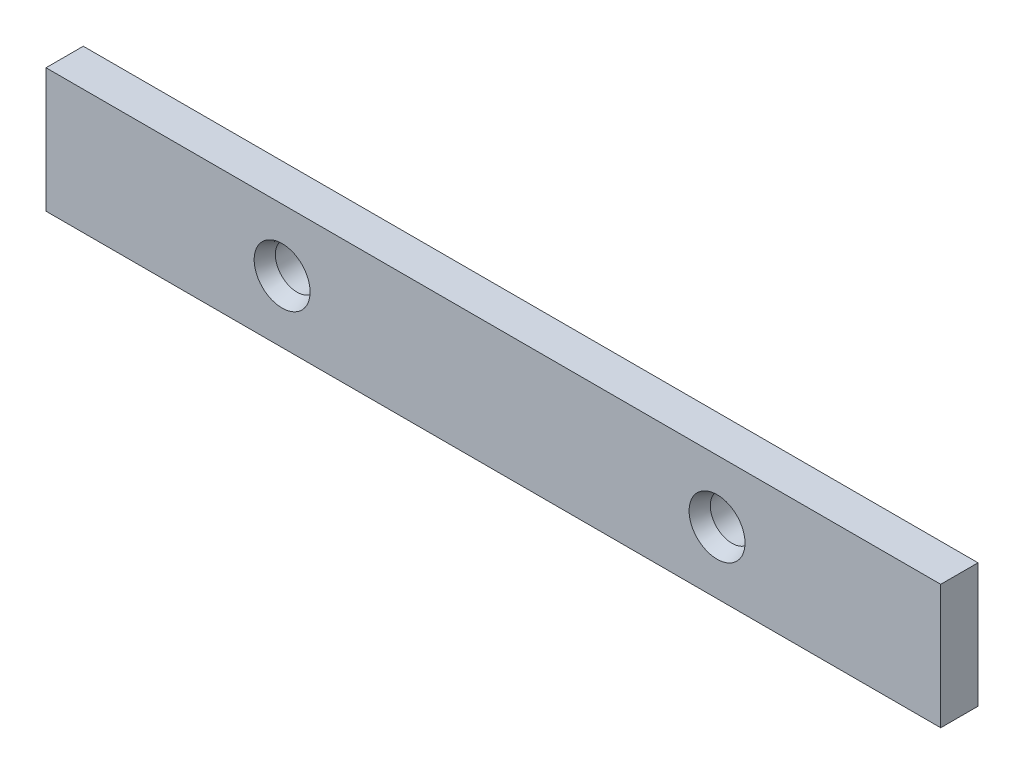
ISO-10303-21;
HEADER;
FILE_DESCRIPTION(('STEP AP214'),'2;1');
FILE_NAME('part.step','',(''),(''),'','','');
FILE_SCHEMA(('AUTOMOTIVE_DESIGN { 1 0 10303 214 1 1 1 1 }'));
ENDSEC;
DATA;
#1=APPLICATION_CONTEXT('core data for automotive mechanical design processes');
#2=APPLICATION_PROTOCOL_DEFINITION('international standard','automotive_design',2000,#1);
#3=PRODUCT_CONTEXT('',#1,'mechanical');
#4=PRODUCT('Part','Part','',(#3));
#5=PRODUCT_RELATED_PRODUCT_CATEGORY('part','',(#4));
#6=PRODUCT_DEFINITION_FORMATION('','',#4);
#7=PRODUCT_DEFINITION_CONTEXT('part definition',#1,'design');
#8=PRODUCT_DEFINITION('design','',#6,#7);
#9=PRODUCT_DEFINITION_SHAPE('','',#8);
#10=(LENGTH_UNIT() NAMED_UNIT(*) SI_UNIT(.MILLI.,.METRE.));
#11=(NAMED_UNIT(*) PLANE_ANGLE_UNIT() SI_UNIT($,.RADIAN.));
#12=(NAMED_UNIT(*) SI_UNIT($,.STERADIAN.) SOLID_ANGLE_UNIT());
#13=UNCERTAINTY_MEASURE_WITH_UNIT(LENGTH_MEASURE(1.E-05),#10,'distance_accuracy_value','');
#14=(GEOMETRIC_REPRESENTATION_CONTEXT(3) GLOBAL_UNCERTAINTY_ASSIGNED_CONTEXT((#13)) GLOBAL_UNIT_ASSIGNED_CONTEXT((#10,
#11,#12)) REPRESENTATION_CONTEXT('',''));
#15=CARTESIAN_POINT('',(0.,0.,0.));
#16=DIRECTION('',(0.,0.,1.));
#17=DIRECTION('',(1.,0.,0.));
#18=AXIS2_PLACEMENT_3D('',#15,#16,#17);
#19=CARTESIAN_POINT('',(72.,10.,3.));
#20=DIRECTION('',(-1.,0.,0.));
#21=DIRECTION('',(0.,0.,1.));
#22=AXIS2_PLACEMENT_3D('',#19,#20,#21);
#23=PLANE('',#22);
#24=DIRECTION('',(0.,1.,0.));
#25=VECTOR('',#24,1.);
#26=CARTESIAN_POINT('',(72.,10.,-3.));
#27=LINE('',#26,#25);
#28=CARTESIAN_POINT('',(72.,-10.,-3.));
#29=VERTEX_POINT('',#28);
#30=CARTESIAN_POINT('',(72.,10.,-3.));
#31=VERTEX_POINT('',#30);
#32=EDGE_CURVE('E96',#29,#31,#27,.T.);
#33=ORIENTED_EDGE('',*,*,#32,.T.);
#34=DIRECTION('',(0.,0.,-1.));
#35=VECTOR('',#34,1.);
#36=CARTESIAN_POINT('',(72.,10.,3.));
#37=LINE('',#36,#35);
#38=CARTESIAN_POINT('',(72.,10.,3.));
#39=VERTEX_POINT('',#38);
#40=EDGE_CURVE('E11',#39,#31,#37,.T.);
#41=ORIENTED_EDGE('',*,*,#40,.F.);
#42=DIRECTION('',(0.,1.,0.));
#43=VECTOR('',#42,1.);
#44=CARTESIAN_POINT('',(72.,10.,3.));
#45=LINE('',#44,#43);
#46=CARTESIAN_POINT('',(72.,-10.,3.));
#47=VERTEX_POINT('',#46);
#48=EDGE_CURVE('E84',#47,#39,#45,.T.);
#49=ORIENTED_EDGE('',*,*,#48,.F.);
#50=DIRECTION('',(0.,0.,-1.));
#51=VECTOR('',#50,1.);
#52=CARTESIAN_POINT('',(72.,-10.,3.));
#53=LINE('',#52,#51);
#54=EDGE_CURVE('E92',#47,#29,#53,.T.);
#55=ORIENTED_EDGE('',*,*,#54,.T.);
#56=EDGE_LOOP('',(#33,#41,#49,#55));
#57=FACE_BOUND('',#56,.T.);
#58=ADVANCED_FACE('F33',(#57),#23,.F.);
#59=CARTESIAN_POINT('',(-72.,10.,3.));
#60=DIRECTION('',(0.,-1.,0.));
#61=DIRECTION('',(0.,0.,-1.));
#62=AXIS2_PLACEMENT_3D('',#59,#60,#61);
#63=PLANE('',#62);
#64=DIRECTION('',(-1.,0.,0.));
#65=VECTOR('',#64,1.);
#66=CARTESIAN_POINT('',(-72.,10.,-3.));
#67=LINE('',#66,#65);
#68=CARTESIAN_POINT('',(-72.,10.,-3.));
#69=VERTEX_POINT('',#68);
#70=EDGE_CURVE('E88',#31,#69,#67,.T.);
#71=ORIENTED_EDGE('',*,*,#70,.T.);
#72=DIRECTION('',(0.,0.,-1.));
#73=VECTOR('',#72,1.);
#74=CARTESIAN_POINT('',(-72.,10.,3.));
#75=LINE('',#74,#73);
#76=CARTESIAN_POINT('',(-72.,10.,3.));
#77=VERTEX_POINT('',#76);
#78=EDGE_CURVE('E41',#77,#69,#75,.T.);
#79=ORIENTED_EDGE('',*,*,#78,.F.);
#80=DIRECTION('',(-1.,0.,0.));
#81=VECTOR('',#80,1.);
#82=CARTESIAN_POINT('',(-72.,10.,3.));
#83=LINE('',#82,#81);
#84=EDGE_CURVE('E79',#39,#77,#83,.T.);
#85=ORIENTED_EDGE('',*,*,#84,.F.);
#86=ORIENTED_EDGE('',*,*,#40,.T.);
#87=EDGE_LOOP('',(#71,#79,#85,#86));
#88=FACE_BOUND('',#87,.T.);
#89=ADVANCED_FACE('F87',(#88),#63,.F.);
#90=CARTESIAN_POINT('',(-72.,10.,3.));
#91=DIRECTION('',(1.,0.,0.));
#92=DIRECTION('',(0.,0.,-1.));
#93=AXIS2_PLACEMENT_3D('',#90,#91,#92);
#94=PLANE('',#93);
#95=DIRECTION('',(0.,-1.,0.));
#96=VECTOR('',#95,1.);
#97=CARTESIAN_POINT('',(-72.,10.,-3.));
#98=LINE('',#97,#96);
#99=CARTESIAN_POINT('',(-72.,-10.,-3.));
#100=VERTEX_POINT('',#99);
#101=EDGE_CURVE('E66',#69,#100,#98,.T.);
#102=ORIENTED_EDGE('',*,*,#101,.T.);
#103=DIRECTION('',(0.,0.,-1.));
#104=VECTOR('',#103,1.);
#105=CARTESIAN_POINT('',(-72.,-10.,3.));
#106=LINE('',#105,#104);
#107=CARTESIAN_POINT('',(-72.,-10.,3.));
#108=VERTEX_POINT('',#107);
#109=EDGE_CURVE('E89',#108,#100,#106,.T.);
#110=ORIENTED_EDGE('',*,*,#109,.F.);
#111=DIRECTION('',(0.,-1.,0.));
#112=VECTOR('',#111,1.);
#113=CARTESIAN_POINT('',(-72.,10.,3.));
#114=LINE('',#113,#112);
#115=EDGE_CURVE('E82',#77,#108,#114,.T.);
#116=ORIENTED_EDGE('',*,*,#115,.F.);
#117=ORIENTED_EDGE('',*,*,#78,.T.);
#118=EDGE_LOOP('',(#102,#110,#116,#117));
#119=FACE_BOUND('',#118,.T.);
#120=ADVANCED_FACE('F90',(#119),#94,.F.);
#121=CARTESIAN_POINT('',(-72.,-10.,3.));
#122=DIRECTION('',(0.,1.,0.));
#123=DIRECTION('',(0.,0.,1.));
#124=AXIS2_PLACEMENT_3D('',#121,#122,#123);
#125=PLANE('',#124);
#126=DIRECTION('',(1.,0.,0.));
#127=VECTOR('',#126,1.);
#128=CARTESIAN_POINT('',(-72.,-10.,-3.));
#129=LINE('',#128,#127);
#130=EDGE_CURVE('E72',#100,#29,#129,.T.);
#131=ORIENTED_EDGE('',*,*,#130,.T.);
#132=ORIENTED_EDGE('',*,*,#54,.F.);
#133=DIRECTION('',(1.,0.,0.));
#134=VECTOR('',#133,1.);
#135=CARTESIAN_POINT('',(-72.,-10.,3.));
#136=LINE('',#135,#134);
#137=EDGE_CURVE('E49',#108,#47,#136,.T.);
#138=ORIENTED_EDGE('',*,*,#137,.F.);
#139=ORIENTED_EDGE('',*,*,#109,.T.);
#140=EDGE_LOOP('',(#131,#132,#138,#139));
#141=FACE_BOUND('',#140,.T.);
#142=ADVANCED_FACE('F104',(#141),#125,.F.);
#143=CARTESIAN_POINT('',(0.,0.,3.));
#144=DIRECTION('',(0.,0.,1.));
#145=DIRECTION('',(1.,0.,0.));
#146=AXIS2_PLACEMENT_3D('',#143,#144,#145);
#147=PLANE('',#146);
#148=CARTESIAN_POINT('',(36.,0.,3.));
#149=DIRECTION('',(0.,0.,1.));
#150=DIRECTION('',(1.,0.,0.));
#151=AXIS2_PLACEMENT_3D('',#148,#149,#150);
#152=CIRCLE('',#151,4.5);
#153=CARTESIAN_POINT('',(40.5,0.,3.));
#154=VERTEX_POINT('',#153);
#155=EDGE_CURVE('E124',#154,#154,#152,.T.);
#156=ORIENTED_EDGE('',*,*,#155,.F.);
#157=EDGE_LOOP('',(#156));
#158=FACE_BOUND('',#157,.T.);
#159=CARTESIAN_POINT('',(-34.,0.,3.));
#160=DIRECTION('',(0.,0.,1.));
#161=DIRECTION('',(1.,0.,0.));
#162=AXIS2_PLACEMENT_3D('',#159,#160,#161);
#163=CIRCLE('',#162,4.5);
#164=CARTESIAN_POINT('',(-29.5,0.,3.));
#165=VERTEX_POINT('',#164);
#166=EDGE_CURVE('E115',#165,#165,#163,.T.);
#167=ORIENTED_EDGE('',*,*,#166,.F.);
#168=EDGE_LOOP('',(#167));
#169=FACE_BOUND('',#168,.T.);
#170=ORIENTED_EDGE('',*,*,#48,.T.);
#171=ORIENTED_EDGE('',*,*,#84,.T.);
#172=ORIENTED_EDGE('',*,*,#115,.T.);
#173=ORIENTED_EDGE('',*,*,#137,.T.);
#174=EDGE_LOOP('',(#170,#171,#172,#173));
#175=FACE_BOUND('',#174,.T.);
#176=ADVANCED_FACE('F80',(#158,#169,#175),#147,.T.);
#177=CARTESIAN_POINT('',(0.,0.,-3.));
#178=DIRECTION('',(0.,0.,1.));
#179=DIRECTION('',(1.,0.,0.));
#180=AXIS2_PLACEMENT_3D('',#177,#178,#179);
#181=PLANE('',#180);
#182=CARTESIAN_POINT('',(36.,0.,-3.));
#183=DIRECTION('',(0.,0.,1.));
#184=DIRECTION('',(1.,0.,0.));
#185=AXIS2_PLACEMENT_3D('',#182,#183,#184);
#186=CIRCLE('',#185,3.5);
#187=CARTESIAN_POINT('',(39.5,0.,-3.));
#188=VERTEX_POINT('',#187);
#189=EDGE_CURVE('E121',#188,#188,#186,.T.);
#190=ORIENTED_EDGE('',*,*,#189,.T.);
#191=EDGE_LOOP('',(#190));
#192=FACE_BOUND('',#191,.T.);
#193=CARTESIAN_POINT('',(-34.,0.,-3.));
#194=DIRECTION('',(0.,0.,1.));
#195=DIRECTION('',(1.,0.,0.));
#196=AXIS2_PLACEMENT_3D('',#193,#194,#195);
#197=CIRCLE('',#196,3.5);
#198=CARTESIAN_POINT('',(-30.5,0.,-3.));
#199=VERTEX_POINT('',#198);
#200=EDGE_CURVE('E99',#199,#199,#197,.T.);
#201=ORIENTED_EDGE('',*,*,#200,.T.);
#202=EDGE_LOOP('',(#201));
#203=FACE_BOUND('',#202,.T.);
#204=ORIENTED_EDGE('',*,*,#32,.F.);
#205=ORIENTED_EDGE('',*,*,#130,.F.);
#206=ORIENTED_EDGE('',*,*,#101,.F.);
#207=ORIENTED_EDGE('',*,*,#70,.F.);
#208=EDGE_LOOP('',(#204,#205,#206,#207));
#209=FACE_BOUND('',#208,.T.);
#210=ADVANCED_FACE('F107',(#192,#203,#209),#181,.F.);
#211=CARTESIAN_POINT('',(-34.,0.,3.));
#212=DIRECTION('',(0.,0.,1.));
#213=DIRECTION('',(1.,0.,0.));
#214=AXIS2_PLACEMENT_3D('',#211,#212,#213);
#215=CYLINDRICAL_SURFACE('',#214,3.5);
#216=ORIENTED_EDGE('',*,*,#200,.F.);
#217=EDGE_LOOP('',(#216));
#218=FACE_BOUND('',#217,.T.);
#219=CARTESIAN_POINT('',(-34.,0.,0.585786437626909));
#220=DIRECTION('',(0.,0.,1.));
#221=DIRECTION('',(1.,0.,0.));
#222=AXIS2_PLACEMENT_3D('',#219,#220,#221);
#223=CIRCLE('',#222,3.5);
#224=CARTESIAN_POINT('',(-30.5,0.,0.585786437626909));
#225=VERTEX_POINT('',#224);
#226=EDGE_CURVE('E112',#225,#225,#223,.T.);
#227=ORIENTED_EDGE('',*,*,#226,.T.);
#228=EDGE_LOOP('',(#227));
#229=FACE_BOUND('',#228,.T.);
#230=ADVANCED_FACE('F138',(#218,#229),#215,.F.);
#231=CARTESIAN_POINT('',(-34.,0.,3.));
#232=DIRECTION('',(0.,0.,1.));
#233=DIRECTION('',(1.,0.,0.));
#234=AXIS2_PLACEMENT_3D('',#231,#232,#233);
#235=CONICAL_SURFACE('',#234,4.5,0.392699081698725);
#236=ORIENTED_EDGE('',*,*,#226,.F.);
#237=EDGE_LOOP('',(#236));
#238=FACE_BOUND('',#237,.T.);
#239=ORIENTED_EDGE('',*,*,#166,.T.);
#240=EDGE_LOOP('',(#239));
#241=FACE_BOUND('',#240,.T.);
#242=ADVANCED_FACE('F135',(#238,#241),#235,.F.);
#243=CARTESIAN_POINT('',(36.,0.,3.));
#244=DIRECTION('',(0.,0.,1.));
#245=DIRECTION('',(1.,0.,0.));
#246=AXIS2_PLACEMENT_3D('',#243,#244,#245);
#247=CYLINDRICAL_SURFACE('',#246,3.5);
#248=ORIENTED_EDGE('',*,*,#189,.F.);
#249=EDGE_LOOP('',(#248));
#250=FACE_BOUND('',#249,.T.);
#251=CARTESIAN_POINT('',(36.,0.,0.585786437626909));
#252=DIRECTION('',(0.,0.,1.));
#253=DIRECTION('',(1.,0.,0.));
#254=AXIS2_PLACEMENT_3D('',#251,#252,#253);
#255=CIRCLE('',#254,3.5);
#256=CARTESIAN_POINT('',(39.5,0.,0.585786437626909));
#257=VERTEX_POINT('',#256);
#258=EDGE_CURVE('E118',#257,#257,#255,.T.);
#259=ORIENTED_EDGE('',*,*,#258,.T.);
#260=EDGE_LOOP('',(#259));
#261=FACE_BOUND('',#260,.T.);
#262=ADVANCED_FACE('F137',(#250,#261),#247,.F.);
#263=CARTESIAN_POINT('',(36.,0.,3.));
#264=DIRECTION('',(0.,0.,1.));
#265=DIRECTION('',(1.,0.,0.));
#266=AXIS2_PLACEMENT_3D('',#263,#264,#265);
#267=CONICAL_SURFACE('',#266,4.5,0.392699081698725);
#268=ORIENTED_EDGE('',*,*,#258,.F.);
#269=EDGE_LOOP('',(#268));
#270=FACE_BOUND('',#269,.T.);
#271=ORIENTED_EDGE('',*,*,#155,.T.);
#272=EDGE_LOOP('',(#271));
#273=FACE_BOUND('',#272,.T.);
#274=ADVANCED_FACE('F128',(#270,#273),#267,.F.);
#275=CLOSED_SHELL('',(#58,#89,#120,#142,#176,#210,#230,#242,#262,#274));
#276=MANIFOLD_SOLID_BREP('B2',#275);
#277=ADVANCED_BREP_SHAPE_REPRESENTATION('',(#18,#276),#14);
#278=SHAPE_DEFINITION_REPRESENTATION(#9,#277);
ENDSEC;
END-ISO-10303-21;
